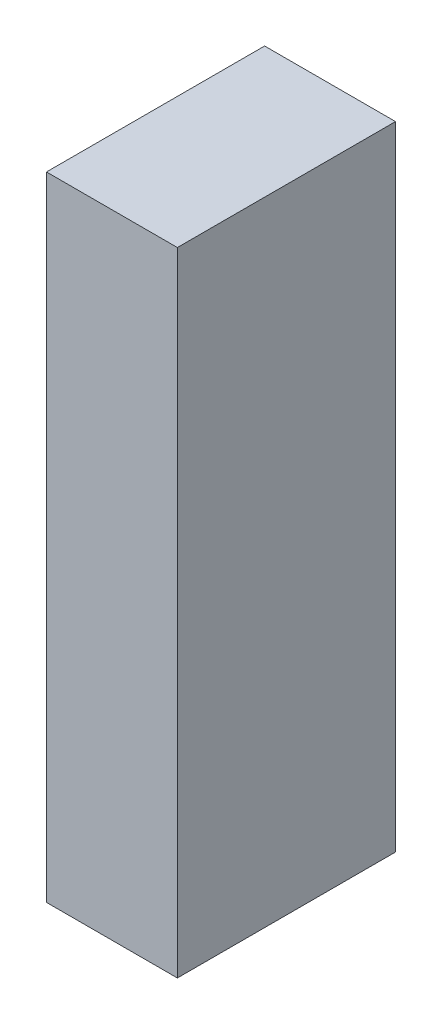
ISO-10303-21;
HEADER;
FILE_DESCRIPTION(('STEP AP214'),'2;1');
FILE_NAME('part.step','',(''),(''),'','','');
FILE_SCHEMA(('AUTOMOTIVE_DESIGN { 1 0 10303 214 1 1 1 1 }'));
ENDSEC;
DATA;
#1=APPLICATION_CONTEXT('core data for automotive mechanical design processes');
#2=APPLICATION_PROTOCOL_DEFINITION('international standard','automotive_design',2000,#1);
#3=PRODUCT_CONTEXT('',#1,'mechanical');
#4=PRODUCT('Part','Part','',(#3));
#5=PRODUCT_RELATED_PRODUCT_CATEGORY('part','',(#4));
#6=PRODUCT_DEFINITION_FORMATION('','',#4);
#7=PRODUCT_DEFINITION_CONTEXT('part definition',#1,'design');
#8=PRODUCT_DEFINITION('design','',#6,#7);
#9=PRODUCT_DEFINITION_SHAPE('','',#8);
#10=(LENGTH_UNIT() NAMED_UNIT(*) SI_UNIT(.MILLI.,.METRE.));
#11=(NAMED_UNIT(*) PLANE_ANGLE_UNIT() SI_UNIT($,.RADIAN.));
#12=(NAMED_UNIT(*) SI_UNIT($,.STERADIAN.) SOLID_ANGLE_UNIT());
#13=UNCERTAINTY_MEASURE_WITH_UNIT(LENGTH_MEASURE(1.E-05),#10,'distance_accuracy_value','');
#14=(GEOMETRIC_REPRESENTATION_CONTEXT(3) GLOBAL_UNCERTAINTY_ASSIGNED_CONTEXT((#13)) GLOBAL_UNIT_ASSIGNED_CONTEXT((#10,
#11,#12)) REPRESENTATION_CONTEXT('',''));
#15=CARTESIAN_POINT('',(0.,0.,0.));
#16=DIRECTION('',(0.,0.,1.));
#17=DIRECTION('',(1.,0.,0.));
#18=AXIS2_PLACEMENT_3D('',#15,#16,#17);
#19=CARTESIAN_POINT('',(0.800004420780567,-0.724995491156804,-2.64111989736557));
#20=DIRECTION('',(-1.74845553146952E-07,-1.,0.));
#21=DIRECTION('',(1.,-1.74845553146952E-07,0.));
#22=AXIS2_PLACEMENT_3D('',#19,#20,#21);
#23=PLANE('',#22);
#24=DIRECTION('',(0.999999999999985,-1.74845553329084E-07,0.));
#25=VECTOR('',#24,1.);
#26=CARTESIAN_POINT('',(0.800004420780567,-0.724995491156804,-2.64111989736557));
#27=LINE('',#26,#25);
#28=CARTESIAN_POINT('',(0.800004420780567,-0.724995491156804,-2.64111989736557));
#29=VERTEX_POINT('',#28);
#30=CARTESIAN_POINT('',(1.10002273132744,-0.724995543613673,-2.64111989736557));
#31=VERTEX_POINT('',#30);
#32=EDGE_CURVE('E11',#29,#31,#27,.T.);
#33=ORIENTED_EDGE('',*,*,#32,.T.);
#34=DIRECTION('',(0.,0.,1.));
#35=VECTOR('',#34,1.);
#36=CARTESIAN_POINT('',(1.10002273132744,-0.724995543613672,-2.64111989736557));
#37=LINE('',#36,#35);
#38=CARTESIAN_POINT('',(1.10002273132744,-0.724995543613673,-2.14112091064453));
#39=VERTEX_POINT('',#38);
#40=EDGE_CURVE('E88',#31,#39,#37,.T.);
#41=ORIENTED_EDGE('',*,*,#40,.T.);
#42=DIRECTION('',(0.999999999999985,-1.74845553329084E-07,0.));
#43=VECTOR('',#42,1.);
#44=CARTESIAN_POINT('',(0.800004420780567,-0.724995491156804,-2.14112091064453));
#45=LINE('',#44,#43);
#46=CARTESIAN_POINT('',(0.800004420780567,-0.724995491156804,-2.14112091064453));
#47=VERTEX_POINT('',#46);
#48=EDGE_CURVE('E83',#47,#39,#45,.T.);
#49=ORIENTED_EDGE('',*,*,#48,.F.);
#50=DIRECTION('',(0.,0.,1.));
#51=VECTOR('',#50,1.);
#52=CARTESIAN_POINT('',(0.800004420780593,-0.724995491156804,-2.64111989736557));
#53=LINE('',#52,#51);
#54=EDGE_CURVE('E72',#29,#47,#53,.T.);
#55=ORIENTED_EDGE('',*,*,#54,.F.);
#56=EDGE_LOOP('',(#33,#41,#49,#55));
#57=FACE_BOUND('',#56,.T.);
#58=ADVANCED_FACE('F17',(#57),#23,.T.);
#59=CARTESIAN_POINT('',(1.10002273132744,-0.724995543613673,-2.64111989736557));
#60=DIRECTION('',(1.,-1.74845553146952E-07,0.));
#61=DIRECTION('',(1.74845553146952E-07,1.,0.));
#62=AXIS2_PLACEMENT_3D('',#59,#60,#61);
#63=PLANE('',#62);
#64=DIRECTION('',(1.74845553118087E-07,0.999999999999985,0.));
#65=VECTOR('',#64,1.);
#66=CARTESIAN_POINT('',(1.10002273132744,-0.724995543613673,-2.64111989736557));
#67=LINE('',#66,#65);
#68=CARTESIAN_POINT('',(1.10002298485432,0.725009034023046,-2.64111989736557));
#69=VERTEX_POINT('',#68);
#70=EDGE_CURVE('E24',#31,#69,#67,.T.);
#71=ORIENTED_EDGE('',*,*,#70,.T.);
#72=DIRECTION('',(0.,0.,1.));
#73=VECTOR('',#72,1.);
#74=CARTESIAN_POINT('',(1.10002298485429,0.725009034023046,-2.64111989736557));
#75=LINE('',#74,#73);
#76=CARTESIAN_POINT('',(1.10002298485432,0.725009034023046,-2.14112091064453));
#77=VERTEX_POINT('',#76);
#78=EDGE_CURVE('E85',#69,#77,#75,.T.);
#79=ORIENTED_EDGE('',*,*,#78,.T.);
#80=DIRECTION('',(1.74845553118087E-07,0.999999999999985,0.));
#81=VECTOR('',#80,1.);
#82=CARTESIAN_POINT('',(1.10002273132744,-0.724995543613673,-2.14112091064453));
#83=LINE('',#82,#81);
#84=EDGE_CURVE('E66',#39,#77,#83,.T.);
#85=ORIENTED_EDGE('',*,*,#84,.F.);
#86=ORIENTED_EDGE('',*,*,#40,.F.);
#87=EDGE_LOOP('',(#71,#79,#85,#86));
#88=FACE_BOUND('',#87,.T.);
#89=ADVANCED_FACE('F89',(#88),#63,.T.);
#90=CARTESIAN_POINT('',(1.10002298485432,0.725009034023046,-2.64111989736557));
#91=DIRECTION('',(1.74845553146952E-07,1.,0.));
#92=DIRECTION('',(-1.,1.74845553146952E-07,0.));
#93=AXIS2_PLACEMENT_3D('',#90,#91,#92);
#94=PLANE('',#93);
#95=DIRECTION('',(-0.999999999999985,1.74845553329084E-07,0.));
#96=VECTOR('',#95,1.);
#97=CARTESIAN_POINT('',(1.10002298485432,0.725009034023046,-2.64111989736557));
#98=LINE('',#97,#96);
#99=CARTESIAN_POINT('',(0.800004674307445,0.725009086479915,-2.64111989736557));
#100=VERTEX_POINT('',#99);
#101=EDGE_CURVE('E62',#69,#100,#98,.T.);
#102=ORIENTED_EDGE('',*,*,#101,.T.);
#103=DIRECTION('',(0.,0.,1.));
#104=VECTOR('',#103,1.);
#105=CARTESIAN_POINT('',(0.800004674307445,0.725009086479913,-2.64111989736557));
#106=LINE('',#105,#104);
#107=CARTESIAN_POINT('',(0.800004674307445,0.725009086479915,-2.14112091064453));
#108=VERTEX_POINT('',#107);
#109=EDGE_CURVE('E55',#100,#108,#106,.T.);
#110=ORIENTED_EDGE('',*,*,#109,.T.);
#111=DIRECTION('',(-0.999999999999985,1.74845553329084E-07,0.));
#112=VECTOR('',#111,1.);
#113=CARTESIAN_POINT('',(1.10002298485432,0.725009034023046,-2.14112091064453));
#114=LINE('',#113,#112);
#115=EDGE_CURVE('E59',#77,#108,#114,.T.);
#116=ORIENTED_EDGE('',*,*,#115,.F.);
#117=ORIENTED_EDGE('',*,*,#78,.F.);
#118=EDGE_LOOP('',(#102,#110,#116,#117));
#119=FACE_BOUND('',#118,.T.);
#120=ADVANCED_FACE('F57',(#119),#94,.T.);
#121=CARTESIAN_POINT('',(0.800004674307445,0.725009086479915,-2.64111989736557));
#122=DIRECTION('',(-1.,1.74845553146952E-07,0.));
#123=DIRECTION('',(-1.74845553146952E-07,-1.,0.));
#124=AXIS2_PLACEMENT_3D('',#121,#122,#123);
#125=PLANE('',#124);
#126=DIRECTION('',(-1.74845553118087E-07,-0.999999999999985,0.));
#127=VECTOR('',#126,1.);
#128=CARTESIAN_POINT('',(0.800004674307445,0.725009086479915,-2.64111989736557));
#129=LINE('',#128,#127);
#130=EDGE_CURVE('E65',#100,#29,#129,.T.);
#131=ORIENTED_EDGE('',*,*,#130,.T.);
#132=ORIENTED_EDGE('',*,*,#54,.T.);
#133=DIRECTION('',(-1.74845553118087E-07,-0.999999999999985,0.));
#134=VECTOR('',#133,1.);
#135=CARTESIAN_POINT('',(0.800004674307445,0.725009086479915,-2.14112091064453));
#136=LINE('',#135,#134);
#137=EDGE_CURVE('E70',#108,#47,#136,.T.);
#138=ORIENTED_EDGE('',*,*,#137,.F.);
#139=ORIENTED_EDGE('',*,*,#109,.F.);
#140=EDGE_LOOP('',(#131,#132,#138,#139));
#141=FACE_BOUND('',#140,.T.);
#142=ADVANCED_FACE('F71',(#141),#125,.T.);
#143=CARTESIAN_POINT('',(-462.125,-95.8249130249023,-2.14112091064453));
#144=DIRECTION('',(0.,0.,1.));
#145=DIRECTION('',(1.,-1.74845553146952E-07,0.));
#146=AXIS2_PLACEMENT_3D('',#143,#144,#145);
#147=PLANE('',#146);
#148=ORIENTED_EDGE('',*,*,#48,.T.);
#149=ORIENTED_EDGE('',*,*,#84,.T.);
#150=ORIENTED_EDGE('',*,*,#115,.T.);
#151=ORIENTED_EDGE('',*,*,#137,.T.);
#152=EDGE_LOOP('',(#148,#149,#150,#151));
#153=FACE_BOUND('',#152,.T.);
#154=ADVANCED_FACE('F76',(#153),#147,.T.);
#155=CARTESIAN_POINT('',(-462.125,-95.8249130249023,-2.64111989736557));
#156=DIRECTION('',(0.,0.,1.));
#157=DIRECTION('',(1.,-1.74845553146952E-07,0.));
#158=AXIS2_PLACEMENT_3D('',#155,#156,#157);
#159=PLANE('',#158);
#160=ORIENTED_EDGE('',*,*,#130,.F.);
#161=ORIENTED_EDGE('',*,*,#101,.F.);
#162=ORIENTED_EDGE('',*,*,#70,.F.);
#163=ORIENTED_EDGE('',*,*,#32,.F.);
#164=EDGE_LOOP('',(#160,#161,#162,#163));
#165=FACE_BOUND('',#164,.T.);
#166=ADVANCED_FACE('F91',(#165),#159,.F.);
#167=CLOSED_SHELL('',(#58,#89,#120,#142,#154,#166));
#168=MANIFOLD_SOLID_BREP('B1',#167);
#169=ADVANCED_BREP_SHAPE_REPRESENTATION('',(#18,#168),#14);
#170=SHAPE_DEFINITION_REPRESENTATION(#9,#169);
ENDSEC;
END-ISO-10303-21;
